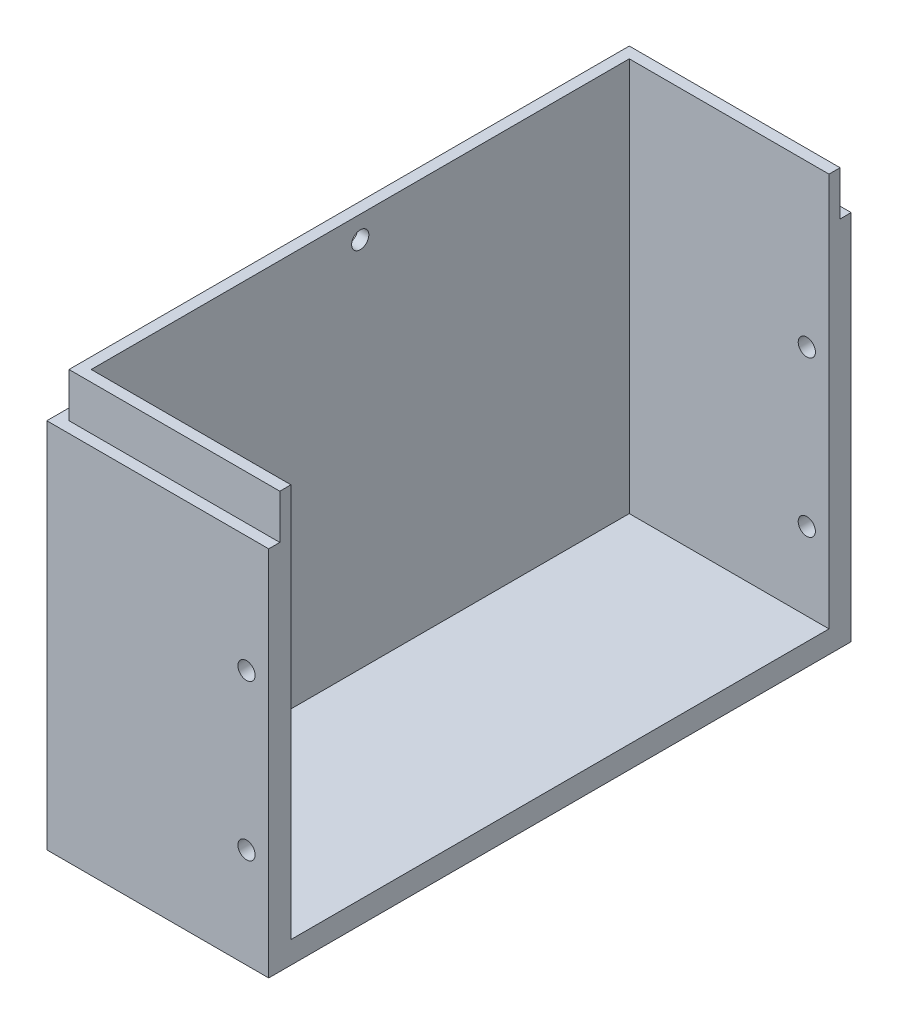
ISO-10303-21;
HEADER;
FILE_DESCRIPTION(('STEP AP214'),'2;1');
FILE_NAME('part.step','',(''),(''),'','','');
FILE_SCHEMA(('AUTOMOTIVE_DESIGN { 1 0 10303 214 1 1 1 1 }'));
ENDSEC;
DATA;
#1=APPLICATION_CONTEXT('core data for automotive mechanical design processes');
#2=APPLICATION_PROTOCOL_DEFINITION('international standard','automotive_design',2000,#1);
#3=PRODUCT_CONTEXT('',#1,'mechanical');
#4=PRODUCT('Part','Part','',(#3));
#5=PRODUCT_RELATED_PRODUCT_CATEGORY('part','',(#4));
#6=PRODUCT_DEFINITION_FORMATION('','',#4);
#7=PRODUCT_DEFINITION_CONTEXT('part definition',#1,'design');
#8=PRODUCT_DEFINITION('design','',#6,#7);
#9=PRODUCT_DEFINITION_SHAPE('','',#8);
#10=(LENGTH_UNIT() NAMED_UNIT(*) SI_UNIT(.MILLI.,.METRE.));
#11=(NAMED_UNIT(*) PLANE_ANGLE_UNIT() SI_UNIT($,.RADIAN.));
#12=(NAMED_UNIT(*) SI_UNIT($,.STERADIAN.) SOLID_ANGLE_UNIT());
#13=UNCERTAINTY_MEASURE_WITH_UNIT(LENGTH_MEASURE(1.E-05),#10,'distance_accuracy_value','');
#14=(GEOMETRIC_REPRESENTATION_CONTEXT(3) GLOBAL_UNCERTAINTY_ASSIGNED_CONTEXT((#13)) GLOBAL_UNIT_ASSIGNED_CONTEXT((#10,
#11,#12)) REPRESENTATION_CONTEXT('',''));
#15=CARTESIAN_POINT('',(0.,0.,0.));
#16=DIRECTION('',(0.,0.,1.));
#17=DIRECTION('',(1.,0.,0.));
#18=AXIS2_PLACEMENT_3D('',#15,#16,#17);
#19=CARTESIAN_POINT('',(0.,75.,0.));
#20=DIRECTION('',(0.,1.,0.));
#21=DIRECTION('',(0.,0.,1.));
#22=AXIS2_PLACEMENT_3D('',#19,#20,#21);
#23=PLANE('',#22);
#24=DIRECTION('',(1.,0.,0.));
#25=VECTOR('',#24,1.);
#26=CARTESIAN_POINT('',(20.,75.,-50.5));
#27=LINE('',#26,#25);
#28=CARTESIAN_POINT('',(-18.,75.,-50.5));
#29=VERTEX_POINT('',#28);
#30=CARTESIAN_POINT('',(20.,75.,-50.5));
#31=VERTEX_POINT('',#30);
#32=EDGE_CURVE('E154',#29,#31,#27,.T.);
#33=ORIENTED_EDGE('',*,*,#32,.F.);
#34=DIRECTION('',(0.,0.,-1.));
#35=VECTOR('',#34,1.);
#36=CARTESIAN_POINT('',(-18.,75.,-50.5));
#37=LINE('',#36,#35);
#38=CARTESIAN_POINT('',(-18.,75.,50.5));
#39=VERTEX_POINT('',#38);
#40=EDGE_CURVE('E57',#39,#29,#37,.T.);
#41=ORIENTED_EDGE('',*,*,#40,.F.);
#42=DIRECTION('',(-1.,0.,0.));
#43=VECTOR('',#42,1.);
#44=CARTESIAN_POINT('',(20.,75.,50.5));
#45=LINE('',#44,#43);
#46=CARTESIAN_POINT('',(20.,75.,50.5));
#47=VERTEX_POINT('',#46);
#48=EDGE_CURVE('E172',#47,#39,#45,.T.);
#49=ORIENTED_EDGE('',*,*,#48,.F.);
#50=DIRECTION('',(0.,0.,-1.));
#51=VECTOR('',#50,1.);
#52=CARTESIAN_POINT('',(20.,75.,-52.5));
#53=LINE('',#52,#51);
#54=CARTESIAN_POINT('',(20.,75.,48.5));
#55=VERTEX_POINT('',#54);
#56=EDGE_CURVE('E227',#47,#55,#53,.T.);
#57=ORIENTED_EDGE('',*,*,#56,.T.);
#58=DIRECTION('',(1.,0.,0.));
#59=VECTOR('',#58,1.);
#60=CARTESIAN_POINT('',(-16.,75.,48.5));
#61=LINE('',#60,#59);
#62=CARTESIAN_POINT('',(-16.,75.,48.5));
#63=VERTEX_POINT('',#62);
#64=EDGE_CURVE('E213',#63,#55,#61,.T.);
#65=ORIENTED_EDGE('',*,*,#64,.F.);
#66=DIRECTION('',(0.,0.,1.));
#67=VECTOR('',#66,1.);
#68=CARTESIAN_POINT('',(-16.,75.,48.5));
#69=LINE('',#68,#67);
#70=CARTESIAN_POINT('',(-16.,75.,-48.5));
#71=VERTEX_POINT('',#70);
#72=EDGE_CURVE('E199',#71,#63,#69,.T.);
#73=ORIENTED_EDGE('',*,*,#72,.F.);
#74=DIRECTION('',(1.,0.,0.));
#75=VECTOR('',#74,1.);
#76=CARTESIAN_POINT('',(-16.,75.,-48.5));
#77=LINE('',#76,#75);
#78=CARTESIAN_POINT('',(20.,75.,-48.5));
#79=VERTEX_POINT('',#78);
#80=EDGE_CURVE('E218',#71,#79,#77,.T.);
#81=ORIENTED_EDGE('',*,*,#80,.T.);
#82=EDGE_CURVE('E231',#79,#31,#53,.T.);
#83=ORIENTED_EDGE('',*,*,#82,.T.);
#84=EDGE_LOOP('',(#33,#41,#49,#57,#65,#73,#81,#83));
#85=FACE_BOUND('',#84,.T.);
#86=ADVANCED_FACE('F39',(#85),#23,.T.);
#87=CARTESIAN_POINT('',(0.,0.,50.5));
#88=DIRECTION('',(0.,0.,-1.));
#89=DIRECTION('',(-1.,0.,0.));
#90=AXIS2_PLACEMENT_3D('',#87,#88,#89);
#91=PLANE('',#90);
#92=DIRECTION('',(0.,1.,0.));
#93=VECTOR('',#92,1.);
#94=CARTESIAN_POINT('',(-18.,75.,50.5));
#95=LINE('',#94,#93);
#96=CARTESIAN_POINT('',(-18.,67.,50.5));
#97=VERTEX_POINT('',#96);
#98=EDGE_CURVE('E140',#97,#39,#95,.T.);
#99=ORIENTED_EDGE('',*,*,#98,.F.);
#100=DIRECTION('',(1.,0.,0.));
#101=VECTOR('',#100,1.);
#102=CARTESIAN_POINT('',(20.,67.,50.5));
#103=LINE('',#102,#101);
#104=CARTESIAN_POINT('',(20.,67.,50.5));
#105=VERTEX_POINT('',#104);
#106=EDGE_CURVE('E137',#97,#105,#103,.T.);
#107=ORIENTED_EDGE('',*,*,#106,.T.);
#108=DIRECTION('',(0.,1.,0.));
#109=VECTOR('',#108,1.);
#110=CARTESIAN_POINT('',(20.,75.,50.5));
#111=LINE('',#110,#109);
#112=EDGE_CURVE('E65',#105,#47,#111,.T.);
#113=ORIENTED_EDGE('',*,*,#112,.T.);
#114=ORIENTED_EDGE('',*,*,#48,.T.);
#115=EDGE_LOOP('',(#99,#107,#113,#114));
#116=FACE_BOUND('',#115,.T.);
#117=ADVANCED_FACE('F313',(#116),#91,.F.);
#118=CARTESIAN_POINT('',(0.,0.,-50.5));
#119=DIRECTION('',(0.,0.,-1.));
#120=DIRECTION('',(-1.,0.,0.));
#121=AXIS2_PLACEMENT_3D('',#118,#119,#120);
#122=PLANE('',#121);
#123=DIRECTION('',(-1.,0.,0.));
#124=VECTOR('',#123,1.);
#125=CARTESIAN_POINT('',(20.,67.,-50.5));
#126=LINE('',#125,#124);
#127=CARTESIAN_POINT('',(20.,67.,-50.5));
#128=VERTEX_POINT('',#127);
#129=CARTESIAN_POINT('',(-18.,67.,-50.5));
#130=VERTEX_POINT('',#129);
#131=EDGE_CURVE('E134',#128,#130,#126,.T.);
#132=ORIENTED_EDGE('',*,*,#131,.T.);
#133=DIRECTION('',(0.,-1.,0.));
#134=VECTOR('',#133,1.);
#135=CARTESIAN_POINT('',(-18.,75.,-50.5));
#136=LINE('',#135,#134);
#137=EDGE_CURVE('E141',#29,#130,#136,.T.);
#138=ORIENTED_EDGE('',*,*,#137,.F.);
#139=ORIENTED_EDGE('',*,*,#32,.T.);
#140=DIRECTION('',(0.,-1.,0.));
#141=VECTOR('',#140,1.);
#142=CARTESIAN_POINT('',(20.,75.,-50.5));
#143=LINE('',#142,#141);
#144=EDGE_CURVE('E151',#31,#128,#143,.T.);
#145=ORIENTED_EDGE('',*,*,#144,.T.);
#146=EDGE_LOOP('',(#132,#138,#139,#145));
#147=FACE_BOUND('',#146,.T.);
#148=ADVANCED_FACE('F149',(#147),#122,.T.);
#149=CARTESIAN_POINT('',(20.,75.,-52.5));
#150=DIRECTION('',(-1.,0.,0.));
#151=DIRECTION('',(0.,0.,1.));
#152=AXIS2_PLACEMENT_3D('',#149,#150,#151);
#153=PLANE('',#152);
#154=DIRECTION('',(0.,-1.,0.));
#155=VECTOR('',#154,1.);
#156=CARTESIAN_POINT('',(20.,75.,-52.5));
#157=LINE('',#156,#155);
#158=CARTESIAN_POINT('',(20.,67.,-52.5));
#159=VERTEX_POINT('',#158);
#160=CARTESIAN_POINT('',(20.,0.,-52.5));
#161=VERTEX_POINT('',#160);
#162=EDGE_CURVE('E11',#159,#161,#157,.T.);
#163=ORIENTED_EDGE('',*,*,#162,.F.);
#164=DIRECTION('',(0.,0.,-1.));
#165=VECTOR('',#164,1.);
#166=CARTESIAN_POINT('',(20.,67.,-50.5));
#167=LINE('',#166,#165);
#168=EDGE_CURVE('E158',#128,#159,#167,.T.);
#169=ORIENTED_EDGE('',*,*,#168,.F.);
#170=ORIENTED_EDGE('',*,*,#144,.F.);
#171=ORIENTED_EDGE('',*,*,#82,.F.);
#172=DIRECTION('',(0.,1.,0.));
#173=VECTOR('',#172,1.);
#174=CARTESIAN_POINT('',(20.,75.,-48.5));
#175=LINE('',#174,#173);
#176=CARTESIAN_POINT('',(20.,4.,-48.5));
#177=VERTEX_POINT('',#176);
#178=EDGE_CURVE('E192',#177,#79,#175,.T.);
#179=ORIENTED_EDGE('',*,*,#178,.F.);
#180=DIRECTION('',(0.,0.,-1.));
#181=VECTOR('',#180,1.);
#182=CARTESIAN_POINT('',(20.,4.,48.5));
#183=LINE('',#182,#181);
#184=CARTESIAN_POINT('',(20.,4.,48.5));
#185=VERTEX_POINT('',#184);
#186=EDGE_CURVE('E207',#185,#177,#183,.T.);
#187=ORIENTED_EDGE('',*,*,#186,.F.);
#188=DIRECTION('',(0.,-1.,0.));
#189=VECTOR('',#188,1.);
#190=CARTESIAN_POINT('',(20.,75.,48.5));
#191=LINE('',#190,#189);
#192=EDGE_CURVE('E184',#55,#185,#191,.T.);
#193=ORIENTED_EDGE('',*,*,#192,.F.);
#194=ORIENTED_EDGE('',*,*,#56,.F.);
#195=ORIENTED_EDGE('',*,*,#112,.F.);
#196=DIRECTION('',(0.,0.,1.));
#197=VECTOR('',#196,1.);
#198=CARTESIAN_POINT('',(20.,67.,50.5));
#199=LINE('',#198,#197);
#200=CARTESIAN_POINT('',(20.,67.,52.5));
#201=VERTEX_POINT('',#200);
#202=EDGE_CURVE('E180',#105,#201,#199,.T.);
#203=ORIENTED_EDGE('',*,*,#202,.T.);
#204=DIRECTION('',(0.,-1.,0.));
#205=VECTOR('',#204,1.);
#206=CARTESIAN_POINT('',(20.,75.,52.5));
#207=LINE('',#206,#205);
#208=CARTESIAN_POINT('',(20.,0.,52.5));
#209=VERTEX_POINT('',#208);
#210=EDGE_CURVE('E230',#201,#209,#207,.T.);
#211=ORIENTED_EDGE('',*,*,#210,.T.);
#212=DIRECTION('',(0.,0.,-1.));
#213=VECTOR('',#212,1.);
#214=CARTESIAN_POINT('',(20.,0.,-52.5));
#215=LINE('',#214,#213);
#216=EDGE_CURVE('E217',#209,#161,#215,.T.);
#217=ORIENTED_EDGE('',*,*,#216,.T.);
#218=EDGE_LOOP('',(#163,#169,#170,#171,#179,#187,#193,#194,#195,#203,#211,#217));
#219=FACE_BOUND('',#218,.T.);
#220=ADVANCED_FACE('F41',(#219),#153,.F.);
#221=CARTESIAN_POINT('',(-20.,75.,-52.5));
#222=DIRECTION('',(0.,0.,1.));
#223=DIRECTION('',(1.,0.,0.));
#224=AXIS2_PLACEMENT_3D('',#221,#222,#223);
#225=PLANE('',#224);
#226=CARTESIAN_POINT('',(16.,18.,-52.5));
#227=DIRECTION('',(0.,0.,-1.));
#228=DIRECTION('',(-1.,0.,0.));
#229=AXIS2_PLACEMENT_3D('',#226,#227,#228);
#230=CIRCLE('',#229,1.55);
#231=CARTESIAN_POINT('',(14.45,18.,-52.5));
#232=VERTEX_POINT('',#231);
#233=EDGE_CURVE('E265',#232,#232,#230,.T.);
#234=ORIENTED_EDGE('',*,*,#233,.F.);
#235=EDGE_LOOP('',(#234));
#236=FACE_BOUND('',#235,.T.);
#237=CARTESIAN_POINT('',(16.,46.,-52.5));
#238=DIRECTION('',(0.,0.,-1.));
#239=DIRECTION('',(-1.,0.,0.));
#240=AXIS2_PLACEMENT_3D('',#237,#238,#239);
#241=CIRCLE('',#240,1.55);
#242=CARTESIAN_POINT('',(14.45,46.,-52.5));
#243=VERTEX_POINT('',#242);
#244=EDGE_CURVE('E275',#243,#243,#241,.T.);
#245=ORIENTED_EDGE('',*,*,#244,.F.);
#246=EDGE_LOOP('',(#245));
#247=FACE_BOUND('',#246,.T.);
#248=DIRECTION('',(0.,-1.,0.));
#249=VECTOR('',#248,1.);
#250=CARTESIAN_POINT('',(-20.,75.,-52.5));
#251=LINE('',#250,#249);
#252=CARTESIAN_POINT('',(-20.,67.,-52.5));
#253=VERTEX_POINT('',#252);
#254=CARTESIAN_POINT('',(-20.,0.,-52.5));
#255=VERTEX_POINT('',#254);
#256=EDGE_CURVE('E49',#253,#255,#251,.T.);
#257=ORIENTED_EDGE('',*,*,#256,.F.);
#258=DIRECTION('',(-1.,0.,0.));
#259=VECTOR('',#258,1.);
#260=CARTESIAN_POINT('',(20.,67.,-52.5));
#261=LINE('',#260,#259);
#262=EDGE_CURVE('E160',#159,#253,#261,.T.);
#263=ORIENTED_EDGE('',*,*,#262,.F.);
#264=ORIENTED_EDGE('',*,*,#162,.T.);
#265=DIRECTION('',(-1.,0.,0.));
#266=VECTOR('',#265,1.);
#267=CARTESIAN_POINT('',(-20.,0.,-52.5));
#268=LINE('',#267,#266);
#269=EDGE_CURVE('E235',#161,#255,#268,.T.);
#270=ORIENTED_EDGE('',*,*,#269,.T.);
#271=EDGE_LOOP('',(#257,#263,#264,#270));
#272=FACE_BOUND('',#271,.T.);
#273=ADVANCED_FACE('F333',(#236,#247,#272),#225,.F.);
#274=CARTESIAN_POINT('',(-20.,75.,-52.5));
#275=DIRECTION('',(1.,0.,0.));
#276=DIRECTION('',(0.,0.,-1.));
#277=AXIS2_PLACEMENT_3D('',#274,#275,#276);
#278=PLANE('',#277);
#279=DIRECTION('',(0.,0.,1.));
#280=VECTOR('',#279,1.);
#281=CARTESIAN_POINT('',(-20.,67.,50.5));
#282=LINE('',#281,#280);
#283=CARTESIAN_POINT('',(-20.,67.,52.5));
#284=VERTEX_POINT('',#283);
#285=EDGE_CURVE('E177',#253,#284,#282,.T.);
#286=ORIENTED_EDGE('',*,*,#285,.F.);
#287=ORIENTED_EDGE('',*,*,#256,.T.);
#288=DIRECTION('',(0.,0.,1.));
#289=VECTOR('',#288,1.);
#290=CARTESIAN_POINT('',(-20.,0.,-52.5));
#291=LINE('',#290,#289);
#292=CARTESIAN_POINT('',(-20.,0.,52.5));
#293=VERTEX_POINT('',#292);
#294=EDGE_CURVE('E239',#255,#293,#291,.T.);
#295=ORIENTED_EDGE('',*,*,#294,.T.);
#296=DIRECTION('',(0.,-1.,0.));
#297=VECTOR('',#296,1.);
#298=CARTESIAN_POINT('',(-20.,75.,52.5));
#299=LINE('',#298,#297);
#300=EDGE_CURVE('E249',#284,#293,#299,.T.);
#301=ORIENTED_EDGE('',*,*,#300,.F.);
#302=EDGE_LOOP('',(#286,#287,#295,#301));
#303=FACE_BOUND('',#302,.T.);
#304=ADVANCED_FACE('F331',(#303),#278,.F.);
#305=CARTESIAN_POINT('',(-20.,75.,52.5));
#306=DIRECTION('',(0.,0.,-1.));
#307=DIRECTION('',(-1.,0.,0.));
#308=AXIS2_PLACEMENT_3D('',#305,#306,#307);
#309=PLANE('',#308);
#310=CARTESIAN_POINT('',(16.,18.,52.5));
#311=DIRECTION('',(0.,0.,-1.));
#312=DIRECTION('',(-1.,0.,0.));
#313=AXIS2_PLACEMENT_3D('',#310,#311,#312);
#314=CIRCLE('',#313,1.55);
#315=CARTESIAN_POINT('',(14.45,18.,52.5));
#316=VERTEX_POINT('',#315);
#317=EDGE_CURVE('E257',#316,#316,#314,.T.);
#318=ORIENTED_EDGE('',*,*,#317,.T.);
#319=EDGE_LOOP('',(#318));
#320=FACE_BOUND('',#319,.T.);
#321=CARTESIAN_POINT('',(16.,46.,52.5));
#322=DIRECTION('',(0.,0.,-1.));
#323=DIRECTION('',(-1.,0.,0.));
#324=AXIS2_PLACEMENT_3D('',#321,#322,#323);
#325=CIRCLE('',#324,1.55);
#326=CARTESIAN_POINT('',(14.45,46.,52.5));
#327=VERTEX_POINT('',#326);
#328=EDGE_CURVE('E271',#327,#327,#325,.T.);
#329=ORIENTED_EDGE('',*,*,#328,.T.);
#330=EDGE_LOOP('',(#329));
#331=FACE_BOUND('',#330,.T.);
#332=ORIENTED_EDGE('',*,*,#210,.F.);
#333=DIRECTION('',(1.,0.,0.));
#334=VECTOR('',#333,1.);
#335=CARTESIAN_POINT('',(20.,67.,52.5));
#336=LINE('',#335,#334);
#337=EDGE_CURVE('E169',#284,#201,#336,.T.);
#338=ORIENTED_EDGE('',*,*,#337,.F.);
#339=ORIENTED_EDGE('',*,*,#300,.T.);
#340=DIRECTION('',(1.,0.,0.));
#341=VECTOR('',#340,1.);
#342=CARTESIAN_POINT('',(-20.,0.,52.5));
#343=LINE('',#342,#341);
#344=EDGE_CURVE('E243',#293,#209,#343,.T.);
#345=ORIENTED_EDGE('',*,*,#344,.T.);
#346=EDGE_LOOP('',(#332,#338,#339,#345));
#347=FACE_BOUND('',#346,.T.);
#348=ADVANCED_FACE('F327',(#320,#331,#347),#309,.F.);
#349=CARTESIAN_POINT('',(0.,0.,0.));
#350=DIRECTION('',(0.,1.,0.));
#351=DIRECTION('',(0.,0.,1.));
#352=AXIS2_PLACEMENT_3D('',#349,#350,#351);
#353=PLANE('',#352);
#354=ORIENTED_EDGE('',*,*,#216,.F.);
#355=ORIENTED_EDGE('',*,*,#344,.F.);
#356=ORIENTED_EDGE('',*,*,#294,.F.);
#357=ORIENTED_EDGE('',*,*,#269,.F.);
#358=EDGE_LOOP('',(#354,#355,#356,#357));
#359=FACE_BOUND('',#358,.T.);
#360=ADVANCED_FACE('F324',(#359),#353,.F.);
#361=CARTESIAN_POINT('',(-16.,75.,48.5));
#362=DIRECTION('',(0.,0.,1.));
#363=DIRECTION('',(1.,0.,0.));
#364=AXIS2_PLACEMENT_3D('',#361,#362,#363);
#365=PLANE('',#364);
#366=CARTESIAN_POINT('',(16.,18.,48.5));
#367=DIRECTION('',(0.,0.,1.));
#368=DIRECTION('',(1.,0.,0.));
#369=AXIS2_PLACEMENT_3D('',#366,#367,#368);
#370=CIRCLE('',#369,1.55);
#371=CARTESIAN_POINT('',(17.55,18.,48.5));
#372=VERTEX_POINT('',#371);
#373=EDGE_CURVE('E147',#372,#372,#370,.T.);
#374=ORIENTED_EDGE('',*,*,#373,.T.);
#375=EDGE_LOOP('',(#374));
#376=FACE_BOUND('',#375,.T.);
#377=CARTESIAN_POINT('',(16.,46.,48.5));
#378=DIRECTION('',(0.,0.,1.));
#379=DIRECTION('',(1.,0.,0.));
#380=AXIS2_PLACEMENT_3D('',#377,#378,#379);
#381=CIRCLE('',#380,1.55);
#382=CARTESIAN_POINT('',(17.55,46.,48.5));
#383=VERTEX_POINT('',#382);
#384=EDGE_CURVE('E256',#383,#383,#381,.T.);
#385=ORIENTED_EDGE('',*,*,#384,.T.);
#386=EDGE_LOOP('',(#385));
#387=FACE_BOUND('',#386,.T.);
#388=ORIENTED_EDGE('',*,*,#192,.T.);
#389=DIRECTION('',(1.,0.,0.));
#390=VECTOR('',#389,1.);
#391=CARTESIAN_POINT('',(-16.,4.,48.5));
#392=LINE('',#391,#390);
#393=CARTESIAN_POINT('',(-16.,4.,48.5));
#394=VERTEX_POINT('',#393);
#395=EDGE_CURVE('E203',#394,#185,#392,.T.);
#396=ORIENTED_EDGE('',*,*,#395,.F.);
#397=DIRECTION('',(0.,-1.,0.));
#398=VECTOR('',#397,1.);
#399=CARTESIAN_POINT('',(-16.,75.,48.5));
#400=LINE('',#399,#398);
#401=EDGE_CURVE('E187',#63,#394,#400,.T.);
#402=ORIENTED_EDGE('',*,*,#401,.F.);
#403=ORIENTED_EDGE('',*,*,#64,.T.);
#404=EDGE_LOOP('',(#388,#396,#402,#403));
#405=FACE_BOUND('',#404,.T.);
#406=ADVANCED_FACE('F322',(#376,#387,#405),#365,.F.);
#407=CARTESIAN_POINT('',(-16.,75.,-48.5));
#408=DIRECTION('',(0.,0.,-1.));
#409=DIRECTION('',(-1.,0.,0.));
#410=AXIS2_PLACEMENT_3D('',#407,#408,#409);
#411=PLANE('',#410);
#412=CARTESIAN_POINT('',(16.,18.,-48.5));
#413=DIRECTION('',(0.,0.,-1.));
#414=DIRECTION('',(-1.,0.,0.));
#415=AXIS2_PLACEMENT_3D('',#412,#413,#414);
#416=CIRCLE('',#415,1.55);
#417=CARTESIAN_POINT('',(14.45,18.,-48.5));
#418=VERTEX_POINT('',#417);
#419=EDGE_CURVE('E43',#418,#418,#416,.T.);
#420=ORIENTED_EDGE('',*,*,#419,.T.);
#421=EDGE_LOOP('',(#420));
#422=FACE_BOUND('',#421,.T.);
#423=CARTESIAN_POINT('',(16.,46.,-48.5));
#424=DIRECTION('',(0.,0.,-1.));
#425=DIRECTION('',(-1.,0.,0.));
#426=AXIS2_PLACEMENT_3D('',#423,#424,#425);
#427=CIRCLE('',#426,1.55);
#428=CARTESIAN_POINT('',(14.45,46.,-48.5));
#429=VERTEX_POINT('',#428);
#430=EDGE_CURVE('E253',#429,#429,#427,.T.);
#431=ORIENTED_EDGE('',*,*,#430,.T.);
#432=EDGE_LOOP('',(#431));
#433=FACE_BOUND('',#432,.T.);
#434=ORIENTED_EDGE('',*,*,#178,.T.);
#435=ORIENTED_EDGE('',*,*,#80,.F.);
#436=DIRECTION('',(0.,1.,0.));
#437=VECTOR('',#436,1.);
#438=CARTESIAN_POINT('',(-16.,75.,-48.5));
#439=LINE('',#438,#437);
#440=CARTESIAN_POINT('',(-16.,4.,-48.5));
#441=VERTEX_POINT('',#440);
#442=EDGE_CURVE('E196',#441,#71,#439,.T.);
#443=ORIENTED_EDGE('',*,*,#442,.F.);
#444=DIRECTION('',(1.,0.,0.));
#445=VECTOR('',#444,1.);
#446=CARTESIAN_POINT('',(-16.,4.,-48.5));
#447=LINE('',#446,#445);
#448=EDGE_CURVE('E222',#441,#177,#447,.T.);
#449=ORIENTED_EDGE('',*,*,#448,.T.);
#450=EDGE_LOOP('',(#434,#435,#443,#449));
#451=FACE_BOUND('',#450,.T.);
#452=ADVANCED_FACE('F292',(#422,#433,#451),#411,.F.);
#453=CARTESIAN_POINT('',(-16.,4.,48.5));
#454=DIRECTION('',(0.,-1.,0.));
#455=DIRECTION('',(0.,0.,-1.));
#456=AXIS2_PLACEMENT_3D('',#453,#454,#455);
#457=PLANE('',#456);
#458=ORIENTED_EDGE('',*,*,#186,.T.);
#459=ORIENTED_EDGE('',*,*,#448,.F.);
#460=DIRECTION('',(0.,0.,-1.));
#461=VECTOR('',#460,1.);
#462=CARTESIAN_POINT('',(-16.,4.,48.5));
#463=LINE('',#462,#461);
#464=EDGE_CURVE('E191',#394,#441,#463,.T.);
#465=ORIENTED_EDGE('',*,*,#464,.F.);
#466=ORIENTED_EDGE('',*,*,#395,.T.);
#467=EDGE_LOOP('',(#458,#459,#465,#466));
#468=FACE_BOUND('',#467,.T.);
#469=ADVANCED_FACE('F373',(#468),#457,.F.);
#470=CARTESIAN_POINT('',(-16.,0.,0.));
#471=DIRECTION('',(1.,0.,0.));
#472=DIRECTION('',(0.,0.,-1.));
#473=AXIS2_PLACEMENT_3D('',#470,#471,#472);
#474=PLANE('',#473);
#475=CARTESIAN_POINT('',(-16.,71.,0.));
#476=DIRECTION('',(-1.,0.,0.));
#477=DIRECTION('',(0.,0.,1.));
#478=AXIS2_PLACEMENT_3D('',#475,#476,#477);
#479=CIRCLE('',#478,1.55);
#480=CARTESIAN_POINT('',(-16.,71.,1.55));
#481=VERTEX_POINT('',#480);
#482=EDGE_CURVE('E279',#481,#481,#479,.T.);
#483=ORIENTED_EDGE('',*,*,#482,.T.);
#484=EDGE_LOOP('',(#483));
#485=FACE_BOUND('',#484,.T.);
#486=ORIENTED_EDGE('',*,*,#401,.T.);
#487=ORIENTED_EDGE('',*,*,#464,.T.);
#488=ORIENTED_EDGE('',*,*,#442,.T.);
#489=ORIENTED_EDGE('',*,*,#72,.T.);
#490=EDGE_LOOP('',(#486,#487,#488,#489));
#491=FACE_BOUND('',#490,.T.);
#492=ADVANCED_FACE('F366',(#485,#491),#474,.T.);
#493=CARTESIAN_POINT('',(20.,67.,50.5));
#494=DIRECTION('',(0.,-1.,0.));
#495=DIRECTION('',(0.,0.,-1.));
#496=AXIS2_PLACEMENT_3D('',#493,#494,#495);
#497=PLANE('',#496);
#498=ORIENTED_EDGE('',*,*,#337,.T.);
#499=ORIENTED_EDGE('',*,*,#202,.F.);
#500=ORIENTED_EDGE('',*,*,#106,.F.);
#501=DIRECTION('',(0.,0.,1.));
#502=VECTOR('',#501,1.);
#503=CARTESIAN_POINT('',(-18.,67.,-50.5));
#504=LINE('',#503,#502);
#505=EDGE_CURVE('E131',#130,#97,#504,.T.);
#506=ORIENTED_EDGE('',*,*,#505,.F.);
#507=ORIENTED_EDGE('',*,*,#131,.F.);
#508=ORIENTED_EDGE('',*,*,#168,.T.);
#509=ORIENTED_EDGE('',*,*,#262,.T.);
#510=ORIENTED_EDGE('',*,*,#285,.T.);
#511=EDGE_LOOP('',(#498,#499,#500,#506,#507,#508,#509,#510));
#512=FACE_BOUND('',#511,.T.);
#513=ADVANCED_FACE('F132',(#512),#497,.F.);
#514=CARTESIAN_POINT('',(-18.,0.,0.));
#515=DIRECTION('',(-1.,0.,0.));
#516=DIRECTION('',(0.,0.,1.));
#517=AXIS2_PLACEMENT_3D('',#514,#515,#516);
#518=PLANE('',#517);
#519=CARTESIAN_POINT('',(-18.,71.,0.));
#520=DIRECTION('',(-1.,0.,0.));
#521=DIRECTION('',(0.,0.,1.));
#522=AXIS2_PLACEMENT_3D('',#519,#520,#521);
#523=CIRCLE('',#522,1.55);
#524=CARTESIAN_POINT('',(-18.,71.,1.55));
#525=VERTEX_POINT('',#524);
#526=EDGE_CURVE('E393',#525,#525,#523,.T.);
#527=ORIENTED_EDGE('',*,*,#526,.F.);
#528=EDGE_LOOP('',(#527));
#529=FACE_BOUND('',#528,.T.);
#530=ORIENTED_EDGE('',*,*,#137,.T.);
#531=ORIENTED_EDGE('',*,*,#505,.T.);
#532=ORIENTED_EDGE('',*,*,#98,.T.);
#533=ORIENTED_EDGE('',*,*,#40,.T.);
#534=EDGE_LOOP('',(#530,#531,#532,#533));
#535=FACE_BOUND('',#534,.T.);
#536=ADVANCED_FACE('F143',(#529,#535),#518,.T.);
#537=CARTESIAN_POINT('',(16.,46.,52.5));
#538=DIRECTION('',(0.,0.,-1.));
#539=DIRECTION('',(-1.,0.,0.));
#540=AXIS2_PLACEMENT_3D('',#537,#538,#539);
#541=CYLINDRICAL_SURFACE('',#540,1.55);
#542=ORIENTED_EDGE('',*,*,#244,.T.);
#543=EDGE_LOOP('',(#542));
#544=FACE_BOUND('',#543,.T.);
#545=ORIENTED_EDGE('',*,*,#430,.F.);
#546=EDGE_LOOP('',(#545));
#547=FACE_BOUND('',#546,.T.);
#548=ADVANCED_FACE('F297',(#544,#547),#541,.F.);
#549=CARTESIAN_POINT('',(16.,18.,52.5));
#550=DIRECTION('',(0.,0.,-1.));
#551=DIRECTION('',(-1.,0.,0.));
#552=AXIS2_PLACEMENT_3D('',#549,#550,#551);
#553=CYLINDRICAL_SURFACE('',#552,1.55);
#554=ORIENTED_EDGE('',*,*,#233,.T.);
#555=EDGE_LOOP('',(#554));
#556=FACE_BOUND('',#555,.T.);
#557=ORIENTED_EDGE('',*,*,#419,.F.);
#558=EDGE_LOOP('',(#557));
#559=FACE_BOUND('',#558,.T.);
#560=ADVANCED_FACE('F294',(#556,#559),#553,.F.);
#561=ORIENTED_EDGE('',*,*,#328,.F.);
#562=EDGE_LOOP('',(#561));
#563=FACE_BOUND('',#562,.T.);
#564=ORIENTED_EDGE('',*,*,#384,.F.);
#565=EDGE_LOOP('',(#564));
#566=FACE_BOUND('',#565,.T.);
#567=ADVANCED_FACE('F296',(#563,#566),#541,.F.);
#568=ORIENTED_EDGE('',*,*,#317,.F.);
#569=EDGE_LOOP('',(#568));
#570=FACE_BOUND('',#569,.T.);
#571=ORIENTED_EDGE('',*,*,#373,.F.);
#572=EDGE_LOOP('',(#571));
#573=FACE_BOUND('',#572,.T.);
#574=ADVANCED_FACE('F300',(#570,#573),#553,.F.);
#575=CARTESIAN_POINT('',(-16.,71.,0.));
#576=DIRECTION('',(-1.,0.,0.));
#577=DIRECTION('',(0.,0.,1.));
#578=AXIS2_PLACEMENT_3D('',#575,#576,#577);
#579=CYLINDRICAL_SURFACE('',#578,1.55);
#580=ORIENTED_EDGE('',*,*,#482,.F.);
#581=EDGE_LOOP('',(#580));
#582=FACE_BOUND('',#581,.T.);
#583=ORIENTED_EDGE('',*,*,#526,.T.);
#584=EDGE_LOOP('',(#583));
#585=FACE_BOUND('',#584,.T.);
#586=ADVANCED_FACE('F310',(#582,#585),#579,.F.);
#587=CLOSED_SHELL('',(#86,#117,#148,#220,#273,#304,#348,#360,#406,#452,#469,#492,#513,#536,#548,
#560,#567,#574,#586));
#588=MANIFOLD_SOLID_BREP('B2',#587);
#589=ADVANCED_BREP_SHAPE_REPRESENTATION('',(#18,#588),#14);
#590=SHAPE_DEFINITION_REPRESENTATION(#9,#589);
ENDSEC;
END-ISO-10303-21;
